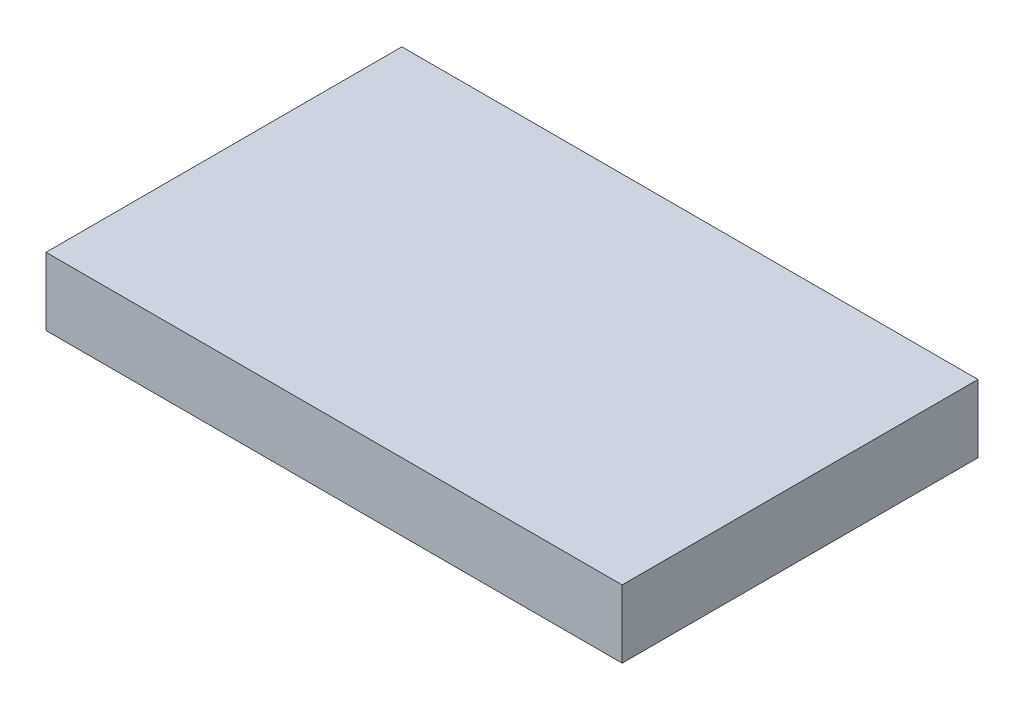
ISO-10303-21;
HEADER;
FILE_DESCRIPTION(('STEP AP214'),'2;1');
FILE_NAME('part.step','',(''),(''),'','','');
FILE_SCHEMA(('AUTOMOTIVE_DESIGN { 1 0 10303 214 1 1 1 1 }'));
ENDSEC;
DATA;
#1=APPLICATION_CONTEXT('core data for automotive mechanical design processes');
#2=APPLICATION_PROTOCOL_DEFINITION('international standard','automotive_design',2000,#1);
#3=PRODUCT_CONTEXT('',#1,'mechanical');
#4=PRODUCT('Part','Part','',(#3));
#5=PRODUCT_RELATED_PRODUCT_CATEGORY('part','',(#4));
#6=PRODUCT_DEFINITION_FORMATION('','',#4);
#7=PRODUCT_DEFINITION_CONTEXT('part definition',#1,'design');
#8=PRODUCT_DEFINITION('design','',#6,#7);
#9=PRODUCT_DEFINITION_SHAPE('','',#8);
#10=(LENGTH_UNIT() NAMED_UNIT(*) SI_UNIT(.MILLI.,.METRE.));
#11=(NAMED_UNIT(*) PLANE_ANGLE_UNIT() SI_UNIT($,.RADIAN.));
#12=(NAMED_UNIT(*) SI_UNIT($,.STERADIAN.) SOLID_ANGLE_UNIT());
#13=UNCERTAINTY_MEASURE_WITH_UNIT(LENGTH_MEASURE(1.E-05),#10,'distance_accuracy_value','');
#14=(GEOMETRIC_REPRESENTATION_CONTEXT(3) GLOBAL_UNCERTAINTY_ASSIGNED_CONTEXT((#13)) GLOBAL_UNIT_ASSIGNED_CONTEXT((#10,
#11,#12)) REPRESENTATION_CONTEXT('',''));
#15=CARTESIAN_POINT('',(0.,0.,0.));
#16=DIRECTION('',(0.,0.,1.));
#17=DIRECTION('',(1.,0.,0.));
#18=AXIS2_PLACEMENT_3D('',#15,#16,#17);
#19=CARTESIAN_POINT('',(8.50000000000005,2.,-5.25000000000003));
#20=DIRECTION('',(-1.,0.,0.));
#21=DIRECTION('',(0.,0.,1.));
#22=AXIS2_PLACEMENT_3D('',#19,#20,#21);
#23=PLANE('',#22);
#24=DIRECTION('',(0.,0.,-1.));
#25=VECTOR('',#24,1.);
#26=CARTESIAN_POINT('',(8.50000000000005,0.,-5.25000000000003));
#27=LINE('',#26,#25);
#28=CARTESIAN_POINT('',(8.50000000000006,0.,5.24999999999998));
#29=VERTEX_POINT('',#28);
#30=CARTESIAN_POINT('',(8.50000000000005,0.,-5.25000000000003));
#31=VERTEX_POINT('',#30);
#32=EDGE_CURVE('E97',#29,#31,#27,.T.);
#33=ORIENTED_EDGE('',*,*,#32,.T.);
#34=DIRECTION('',(0.,-1.,0.));
#35=VECTOR('',#34,1.);
#36=CARTESIAN_POINT('',(8.50000000000005,2.,-5.25000000000003));
#37=LINE('',#36,#35);
#38=CARTESIAN_POINT('',(8.50000000000005,2.,-5.25000000000003));
#39=VERTEX_POINT('',#38);
#40=EDGE_CURVE('E11',#39,#31,#37,.T.);
#41=ORIENTED_EDGE('',*,*,#40,.F.);
#42=DIRECTION('',(0.,0.,-1.));
#43=VECTOR('',#42,1.);
#44=CARTESIAN_POINT('',(8.50000000000005,2.,-5.25000000000003));
#45=LINE('',#44,#43);
#46=CARTESIAN_POINT('',(8.50000000000006,2.,5.24999999999998));
#47=VERTEX_POINT('',#46);
#48=EDGE_CURVE('E85',#47,#39,#45,.T.);
#49=ORIENTED_EDGE('',*,*,#48,.F.);
#50=DIRECTION('',(0.,-1.,0.));
#51=VECTOR('',#50,1.);
#52=CARTESIAN_POINT('',(8.50000000000006,2.,5.24999999999998));
#53=LINE('',#52,#51);
#54=EDGE_CURVE('E93',#47,#29,#53,.T.);
#55=ORIENTED_EDGE('',*,*,#54,.T.);
#56=EDGE_LOOP('',(#33,#41,#49,#55));
#57=FACE_BOUND('',#56,.T.);
#58=ADVANCED_FACE('F34',(#57),#23,.F.);
#59=CARTESIAN_POINT('',(-8.49999999999995,2.,-5.25000000000003));
#60=DIRECTION('',(0.,0.,1.));
#61=DIRECTION('',(1.,0.,0.));
#62=AXIS2_PLACEMENT_3D('',#59,#60,#61);
#63=PLANE('',#62);
#64=DIRECTION('',(-1.,0.,0.));
#65=VECTOR('',#64,1.);
#66=CARTESIAN_POINT('',(-8.49999999999995,0.,-5.25000000000003));
#67=LINE('',#66,#65);
#68=CARTESIAN_POINT('',(-8.49999999999995,0.,-5.25000000000003));
#69=VERTEX_POINT('',#68);
#70=EDGE_CURVE('E89',#31,#69,#67,.T.);
#71=ORIENTED_EDGE('',*,*,#70,.T.);
#72=DIRECTION('',(0.,-1.,0.));
#73=VECTOR('',#72,1.);
#74=CARTESIAN_POINT('',(-8.49999999999995,2.,-5.25000000000003));
#75=LINE('',#74,#73);
#76=CARTESIAN_POINT('',(-8.49999999999995,2.,-5.25000000000003));
#77=VERTEX_POINT('',#76);
#78=EDGE_CURVE('E42',#77,#69,#75,.T.);
#79=ORIENTED_EDGE('',*,*,#78,.F.);
#80=DIRECTION('',(-1.,0.,0.));
#81=VECTOR('',#80,1.);
#82=CARTESIAN_POINT('',(-8.49999999999995,2.,-5.25000000000003));
#83=LINE('',#82,#81);
#84=EDGE_CURVE('E80',#39,#77,#83,.T.);
#85=ORIENTED_EDGE('',*,*,#84,.F.);
#86=ORIENTED_EDGE('',*,*,#40,.T.);
#87=EDGE_LOOP('',(#71,#79,#85,#86));
#88=FACE_BOUND('',#87,.T.);
#89=ADVANCED_FACE('F88',(#88),#63,.F.);
#90=CARTESIAN_POINT('',(-8.49999999999995,2.,-5.25000000000003));
#91=DIRECTION('',(1.,0.,0.));
#92=DIRECTION('',(0.,0.,-1.));
#93=AXIS2_PLACEMENT_3D('',#90,#91,#92);
#94=PLANE('',#93);
#95=DIRECTION('',(0.,0.,1.));
#96=VECTOR('',#95,1.);
#97=CARTESIAN_POINT('',(-8.49999999999995,0.,-5.25000000000003));
#98=LINE('',#97,#96);
#99=CARTESIAN_POINT('',(-8.49999999999995,0.,5.24999999999998));
#100=VERTEX_POINT('',#99);
#101=EDGE_CURVE('E67',#69,#100,#98,.T.);
#102=ORIENTED_EDGE('',*,*,#101,.T.);
#103=DIRECTION('',(0.,-1.,0.));
#104=VECTOR('',#103,1.);
#105=CARTESIAN_POINT('',(-8.49999999999995,2.,5.24999999999998));
#106=LINE('',#105,#104);
#107=CARTESIAN_POINT('',(-8.49999999999995,2.,5.24999999999998));
#108=VERTEX_POINT('',#107);
#109=EDGE_CURVE('E90',#108,#100,#106,.T.);
#110=ORIENTED_EDGE('',*,*,#109,.F.);
#111=DIRECTION('',(0.,0.,1.));
#112=VECTOR('',#111,1.);
#113=CARTESIAN_POINT('',(-8.49999999999995,2.,-5.25000000000003));
#114=LINE('',#113,#112);
#115=EDGE_CURVE('E83',#77,#108,#114,.T.);
#116=ORIENTED_EDGE('',*,*,#115,.F.);
#117=ORIENTED_EDGE('',*,*,#78,.T.);
#118=EDGE_LOOP('',(#102,#110,#116,#117));
#119=FACE_BOUND('',#118,.T.);
#120=ADVANCED_FACE('F91',(#119),#94,.F.);
#121=CARTESIAN_POINT('',(-8.49999999999995,2.,5.24999999999998));
#122=DIRECTION('',(0.,0.,-1.));
#123=DIRECTION('',(-1.,0.,0.));
#124=AXIS2_PLACEMENT_3D('',#121,#122,#123);
#125=PLANE('',#124);
#126=DIRECTION('',(1.,0.,0.));
#127=VECTOR('',#126,1.);
#128=CARTESIAN_POINT('',(-8.49999999999995,0.,5.24999999999998));
#129=LINE('',#128,#127);
#130=EDGE_CURVE('E73',#100,#29,#129,.T.);
#131=ORIENTED_EDGE('',*,*,#130,.T.);
#132=ORIENTED_EDGE('',*,*,#54,.F.);
#133=DIRECTION('',(1.,0.,0.));
#134=VECTOR('',#133,1.);
#135=CARTESIAN_POINT('',(-8.49999999999995,2.,5.24999999999998));
#136=LINE('',#135,#134);
#137=EDGE_CURVE('E50',#108,#47,#136,.T.);
#138=ORIENTED_EDGE('',*,*,#137,.F.);
#139=ORIENTED_EDGE('',*,*,#109,.T.);
#140=EDGE_LOOP('',(#131,#132,#138,#139));
#141=FACE_BOUND('',#140,.T.);
#142=ADVANCED_FACE('F104',(#141),#125,.F.);
#143=CARTESIAN_POINT('',(0.,2.,0.));
#144=DIRECTION('',(0.,1.,0.));
#145=DIRECTION('',(0.,0.,1.));
#146=AXIS2_PLACEMENT_3D('',#143,#144,#145);
#147=PLANE('',#146);
#148=ORIENTED_EDGE('',*,*,#48,.T.);
#149=ORIENTED_EDGE('',*,*,#84,.T.);
#150=ORIENTED_EDGE('',*,*,#115,.T.);
#151=ORIENTED_EDGE('',*,*,#137,.T.);
#152=EDGE_LOOP('',(#148,#149,#150,#151));
#153=FACE_BOUND('',#152,.T.);
#154=ADVANCED_FACE('F81',(#153),#147,.T.);
#155=CARTESIAN_POINT('',(0.,0.,0.));
#156=DIRECTION('',(0.,1.,0.));
#157=DIRECTION('',(0.,0.,1.));
#158=AXIS2_PLACEMENT_3D('',#155,#156,#157);
#159=PLANE('',#158);
#160=ORIENTED_EDGE('',*,*,#32,.F.);
#161=ORIENTED_EDGE('',*,*,#130,.F.);
#162=ORIENTED_EDGE('',*,*,#101,.F.);
#163=ORIENTED_EDGE('',*,*,#70,.F.);
#164=EDGE_LOOP('',(#160,#161,#162,#163));
#165=FACE_BOUND('',#164,.T.);
#166=ADVANCED_FACE('F107',(#165),#159,.F.);
#167=CLOSED_SHELL('',(#58,#89,#120,#142,#154,#166));
#168=MANIFOLD_SOLID_BREP('B2',#167);
#169=ADVANCED_BREP_SHAPE_REPRESENTATION('',(#18,#168),#14);
#170=SHAPE_DEFINITION_REPRESENTATION(#9,#169);
ENDSEC;
END-ISO-10303-21;
